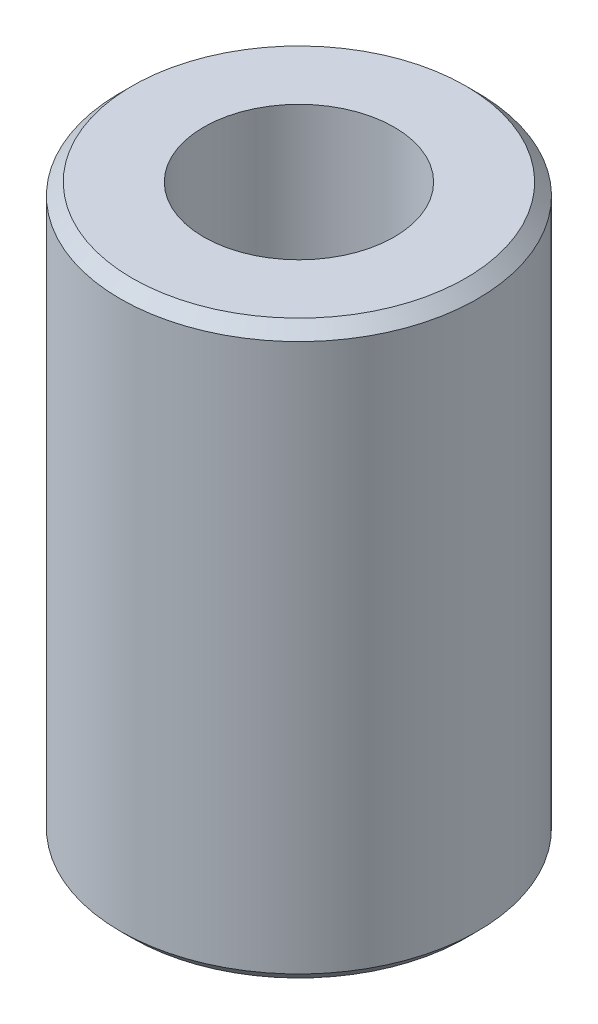
ISO-10303-21;
HEADER;
FILE_DESCRIPTION(('STEP AP214'),'2;1');
FILE_NAME('part.step','',(''),(''),'','','');
FILE_SCHEMA(('AUTOMOTIVE_DESIGN { 1 0 10303 214 1 1 1 1 }'));
ENDSEC;
DATA;
#1=APPLICATION_CONTEXT('core data for automotive mechanical design processes');
#2=APPLICATION_PROTOCOL_DEFINITION('international standard','automotive_design',2000,#1);
#3=PRODUCT_CONTEXT('',#1,'mechanical');
#4=PRODUCT('Part','Part','',(#3));
#5=PRODUCT_RELATED_PRODUCT_CATEGORY('part','',(#4));
#6=PRODUCT_DEFINITION_FORMATION('','',#4);
#7=PRODUCT_DEFINITION_CONTEXT('part definition',#1,'design');
#8=PRODUCT_DEFINITION('design','',#6,#7);
#9=PRODUCT_DEFINITION_SHAPE('','',#8);
#10=(LENGTH_UNIT() NAMED_UNIT(*) SI_UNIT(.MILLI.,.METRE.));
#11=(NAMED_UNIT(*) PLANE_ANGLE_UNIT() SI_UNIT($,.RADIAN.));
#12=(NAMED_UNIT(*) SI_UNIT($,.STERADIAN.) SOLID_ANGLE_UNIT());
#13=UNCERTAINTY_MEASURE_WITH_UNIT(LENGTH_MEASURE(1.E-05),#10,'distance_accuracy_value','');
#14=(GEOMETRIC_REPRESENTATION_CONTEXT(3) GLOBAL_UNCERTAINTY_ASSIGNED_CONTEXT((#13)) GLOBAL_UNIT_ASSIGNED_CONTEXT((#10,
#11,#12)) REPRESENTATION_CONTEXT('',''));
#15=CARTESIAN_POINT('',(0.,0.,0.));
#16=DIRECTION('',(0.,0.,1.));
#17=DIRECTION('',(1.,0.,0.));
#18=AXIS2_PLACEMENT_3D('',#15,#16,#17);
#19=CARTESIAN_POINT('',(0.,24.,0.));
#20=DIRECTION('',(0.,1.,0.));
#21=DIRECTION('',(0.,0.,1.));
#22=AXIS2_PLACEMENT_3D('',#19,#20,#21);
#23=PLANE('',#22);
#24=CARTESIAN_POINT('',(0.,24.,0.));
#25=DIRECTION('',(0.,1.,0.));
#26=DIRECTION('',(0.,0.,1.));
#27=AXIS2_PLACEMENT_3D('',#24,#25,#26);
#28=CIRCLE('',#27,7.);
#29=CARTESIAN_POINT('',(0.,24.,7.));
#30=VERTEX_POINT('',#29);
#31=EDGE_CURVE('E45',#30,#30,#28,.T.);
#32=ORIENTED_EDGE('',*,*,#31,.T.);
#33=EDGE_LOOP('',(#32));
#34=FACE_BOUND('',#33,.T.);
#35=CARTESIAN_POINT('',(0.,24.,0.));
#36=DIRECTION('',(0.,1.,0.));
#37=DIRECTION('',(0.,0.,1.));
#38=AXIS2_PLACEMENT_3D('',#35,#36,#37);
#39=CIRCLE('',#38,4.);
#40=CARTESIAN_POINT('',(0.,24.,4.));
#41=VERTEX_POINT('',#40);
#42=EDGE_CURVE('E50',#41,#41,#39,.T.);
#43=ORIENTED_EDGE('',*,*,#42,.F.);
#44=EDGE_LOOP('',(#43));
#45=FACE_BOUND('',#44,.T.);
#46=ADVANCED_FACE('F30',(#34,#45),#23,.T.);
#47=CARTESIAN_POINT('',(0.,0.,0.));
#48=DIRECTION('',(0.,1.,0.));
#49=DIRECTION('',(0.,0.,1.));
#50=AXIS2_PLACEMENT_3D('',#47,#48,#49);
#51=PLANE('',#50);
#52=CARTESIAN_POINT('',(0.,0.,0.));
#53=DIRECTION('',(0.,1.,0.));
#54=DIRECTION('',(0.,0.,1.));
#55=AXIS2_PLACEMENT_3D('',#52,#53,#54);
#56=CIRCLE('',#55,7.);
#57=CARTESIAN_POINT('',(0.,0.,7.));
#58=VERTEX_POINT('',#57);
#59=EDGE_CURVE('E10',#58,#58,#56,.F.);
#60=ORIENTED_EDGE('',*,*,#59,.T.);
#61=EDGE_LOOP('',(#60));
#62=FACE_BOUND('',#61,.T.);
#63=CARTESIAN_POINT('',(0.,0.,0.));
#64=DIRECTION('',(0.,1.,0.));
#65=DIRECTION('',(0.,0.,1.));
#66=AXIS2_PLACEMENT_3D('',#63,#64,#65);
#67=CIRCLE('',#66,4.);
#68=CARTESIAN_POINT('',(0.,0.,4.));
#69=VERTEX_POINT('',#68);
#70=EDGE_CURVE('E51',#69,#69,#67,.T.);
#71=ORIENTED_EDGE('',*,*,#70,.T.);
#72=EDGE_LOOP('',(#71));
#73=FACE_BOUND('',#72,.T.);
#74=ADVANCED_FACE('F61',(#62,#73),#51,.F.);
#75=CARTESIAN_POINT('',(0.,24.,0.));
#76=DIRECTION('',(0.,-1.,0.));
#77=DIRECTION('',(0.,0.,-1.));
#78=AXIS2_PLACEMENT_3D('',#75,#76,#77);
#79=CYLINDRICAL_SURFACE('',#78,7.5);
#80=CARTESIAN_POINT('',(0.,23.5,0.));
#81=DIRECTION('',(0.,1.,0.));
#82=DIRECTION('',(0.,0.,1.));
#83=AXIS2_PLACEMENT_3D('',#80,#81,#82);
#84=CIRCLE('',#83,7.5);
#85=CARTESIAN_POINT('',(0.,23.5,7.5));
#86=VERTEX_POINT('',#85);
#87=EDGE_CURVE('E37',#86,#86,#84,.F.);
#88=ORIENTED_EDGE('',*,*,#87,.T.);
#89=EDGE_LOOP('',(#88));
#90=FACE_BOUND('',#89,.T.);
#91=CARTESIAN_POINT('',(0.,0.500000000000004,0.));
#92=DIRECTION('',(0.,1.,0.));
#93=DIRECTION('',(0.,0.,1.));
#94=AXIS2_PLACEMENT_3D('',#91,#92,#93);
#95=CIRCLE('',#94,7.5);
#96=CARTESIAN_POINT('',(0.,0.500000000000004,7.5));
#97=VERTEX_POINT('',#96);
#98=EDGE_CURVE('E41',#97,#97,#95,.T.);
#99=ORIENTED_EDGE('',*,*,#98,.T.);
#100=EDGE_LOOP('',(#99));
#101=FACE_BOUND('',#100,.T.);
#102=ADVANCED_FACE('F67',(#90,#101),#79,.T.);
#103=CARTESIAN_POINT('',(0.,24.,0.));
#104=DIRECTION('',(0.,-1.,0.));
#105=DIRECTION('',(0.,0.,-1.));
#106=AXIS2_PLACEMENT_3D('',#103,#104,#105);
#107=CYLINDRICAL_SURFACE('',#106,4.);
#108=ORIENTED_EDGE('',*,*,#42,.T.);
#109=EDGE_LOOP('',(#108));
#110=FACE_BOUND('',#109,.T.);
#111=ORIENTED_EDGE('',*,*,#70,.F.);
#112=EDGE_LOOP('',(#111));
#113=FACE_BOUND('',#112,.T.);
#114=ADVANCED_FACE('F57',(#110,#113),#107,.F.);
#115=CARTESIAN_POINT('',(0.,24.,0.));
#116=DIRECTION('',(0.,-1.,0.));
#117=DIRECTION('',(0.,0.,-1.));
#118=AXIS2_PLACEMENT_3D('',#115,#116,#117);
#119=CONICAL_SURFACE('',#118,7.,0.785398163397449);
#120=ORIENTED_EDGE('',*,*,#87,.F.);
#121=EDGE_LOOP('',(#120));
#122=FACE_BOUND('',#121,.T.);
#123=ORIENTED_EDGE('',*,*,#31,.F.);
#124=EDGE_LOOP('',(#123));
#125=FACE_BOUND('',#124,.T.);
#126=ADVANCED_FACE('F72',(#122,#125),#119,.T.);
#127=CARTESIAN_POINT('',(0.,0.500000000000004,0.));
#128=DIRECTION('',(0.,1.,0.));
#129=DIRECTION('',(0.,0.,1.));
#130=AXIS2_PLACEMENT_3D('',#127,#128,#129);
#131=CONICAL_SURFACE('',#130,7.5,0.785398163397447);
#132=ORIENTED_EDGE('',*,*,#59,.F.);
#133=EDGE_LOOP('',(#132));
#134=FACE_BOUND('',#133,.T.);
#135=ORIENTED_EDGE('',*,*,#98,.F.);
#136=EDGE_LOOP('',(#135));
#137=FACE_BOUND('',#136,.T.);
#138=ADVANCED_FACE('F32',(#134,#137),#131,.T.);
#139=CLOSED_SHELL('',(#46,#74,#102,#114,#126,#138));
#140=MANIFOLD_SOLID_BREP('B2',#139);
#141=ADVANCED_BREP_SHAPE_REPRESENTATION('',(#18,#140),#14);
#142=SHAPE_DEFINITION_REPRESENTATION(#9,#141);
ENDSEC;
END-ISO-10303-21;
